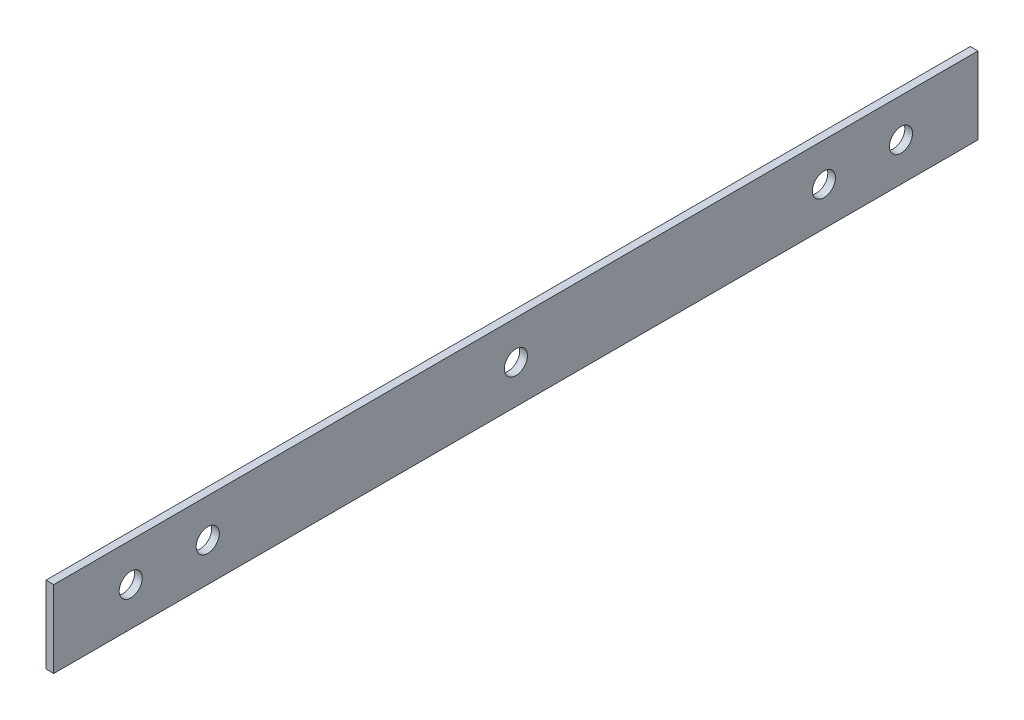
ISO-10303-21;
HEADER;
FILE_DESCRIPTION(('STEP AP214'),'2;1');
FILE_NAME('part.step','',(''),(''),'','','');
FILE_SCHEMA(('AUTOMOTIVE_DESIGN { 1 0 10303 214 1 1 1 1 }'));
ENDSEC;
DATA;
#1=APPLICATION_CONTEXT('core data for automotive mechanical design processes');
#2=APPLICATION_PROTOCOL_DEFINITION('international standard','automotive_design',2000,#1);
#3=PRODUCT_CONTEXT('',#1,'mechanical');
#4=PRODUCT('Part','Part','',(#3));
#5=PRODUCT_RELATED_PRODUCT_CATEGORY('part','',(#4));
#6=PRODUCT_DEFINITION_FORMATION('','',#4);
#7=PRODUCT_DEFINITION_CONTEXT('part definition',#1,'design');
#8=PRODUCT_DEFINITION('design','',#6,#7);
#9=PRODUCT_DEFINITION_SHAPE('','',#8);
#10=(LENGTH_UNIT() NAMED_UNIT(*) SI_UNIT(.MILLI.,.METRE.));
#11=(NAMED_UNIT(*) PLANE_ANGLE_UNIT() SI_UNIT($,.RADIAN.));
#12=(NAMED_UNIT(*) SI_UNIT($,.STERADIAN.) SOLID_ANGLE_UNIT());
#13=UNCERTAINTY_MEASURE_WITH_UNIT(LENGTH_MEASURE(1.E-05),#10,'distance_accuracy_value','');
#14=(GEOMETRIC_REPRESENTATION_CONTEXT(3) GLOBAL_UNCERTAINTY_ASSIGNED_CONTEXT((#13)) GLOBAL_UNIT_ASSIGNED_CONTEXT((#10,
#11,#12)) REPRESENTATION_CONTEXT('',''));
#15=CARTESIAN_POINT('',(0.,0.,0.));
#16=DIRECTION('',(0.,0.,1.));
#17=DIRECTION('',(1.,0.,0.));
#18=AXIS2_PLACEMENT_3D('',#15,#16,#17);
#19=CARTESIAN_POINT('',(1.,0.,0.));
#20=DIRECTION('',(1.,0.,0.));
#21=DIRECTION('',(0.,0.,-1.));
#22=AXIS2_PLACEMENT_3D('',#19,#20,#21);
#23=PLANE('',#22);
#24=CARTESIAN_POINT('',(1.,-1.84898231564898,-7.04768768768769));
#25=DIRECTION('',(1.,0.,0.));
#26=DIRECTION('',(0.,0.,-1.));
#27=AXIS2_PLACEMENT_3D('',#24,#25,#26);
#28=CIRCLE('',#27,1.5);
#29=CARTESIAN_POINT('',(1.,-1.84898231564898,-8.54768768768769));
#30=VERTEX_POINT('',#29);
#31=EDGE_CURVE('E150',#30,#30,#28,.T.);
#32=ORIENTED_EDGE('',*,*,#31,.F.);
#33=EDGE_LOOP('',(#32));
#34=FACE_BOUND('',#33,.T.);
#35=CARTESIAN_POINT('',(1.,-1.84898231564898,2.95231231231231));
#36=DIRECTION('',(1.,0.,0.));
#37=DIRECTION('',(0.,0.,-1.));
#38=AXIS2_PLACEMENT_3D('',#35,#36,#37);
#39=CIRCLE('',#38,1.5);
#40=CARTESIAN_POINT('',(1.,-1.84898231564898,1.45231231231231));
#41=VERTEX_POINT('',#40);
#42=EDGE_CURVE('E134',#41,#41,#39,.T.);
#43=ORIENTED_EDGE('',*,*,#42,.F.);
#44=EDGE_LOOP('',(#43));
#45=FACE_BOUND('',#44,.T.);
#46=DIRECTION('',(0.,-1.,0.));
#47=VECTOR('',#46,1.);
#48=CARTESIAN_POINT('',(1.,3.15101768435102,102.952312312312));
#49=LINE('',#48,#47);
#50=CARTESIAN_POINT('',(1.,3.15101768435102,102.952312312312));
#51=VERTEX_POINT('',#50);
#52=CARTESIAN_POINT('',(1.,-6.84898231564898,102.952312312312));
#53=VERTEX_POINT('',#52);
#54=EDGE_CURVE('E92',#51,#53,#49,.T.);
#55=ORIENTED_EDGE('',*,*,#54,.T.);
#56=DIRECTION('',(0.,0.,-1.));
#57=VECTOR('',#56,1.);
#58=CARTESIAN_POINT('',(1.,-6.84898231564898,102.952312312312));
#59=LINE('',#58,#57);
#60=CARTESIAN_POINT('',(1.,-6.84898231564898,-17.0476876876877));
#61=VERTEX_POINT('',#60);
#62=EDGE_CURVE('E87',#53,#61,#59,.T.);
#63=ORIENTED_EDGE('',*,*,#62,.T.);
#64=DIRECTION('',(0.,1.,0.));
#65=VECTOR('',#64,1.);
#66=CARTESIAN_POINT('',(1.,3.15101768435102,-17.0476876876877));
#67=LINE('',#66,#65);
#68=CARTESIAN_POINT('',(1.,3.15101768435102,-17.0476876876877));
#69=VERTEX_POINT('',#68);
#70=EDGE_CURVE('E90',#61,#69,#67,.T.);
#71=ORIENTED_EDGE('',*,*,#70,.T.);
#72=DIRECTION('',(0.,0.,1.));
#73=VECTOR('',#72,1.);
#74=CARTESIAN_POINT('',(1.,3.15101768435102,102.952312312312));
#75=LINE('',#74,#73);
#76=EDGE_CURVE('E57',#69,#51,#75,.T.);
#77=ORIENTED_EDGE('',*,*,#76,.T.);
#78=EDGE_LOOP('',(#55,#63,#71,#77));
#79=FACE_BOUND('',#78,.T.);
#80=CARTESIAN_POINT('',(1.,-1.84898231564898,82.9523123123123));
#81=DIRECTION('',(1.,0.,0.));
#82=DIRECTION('',(0.,0.,-1.));
#83=AXIS2_PLACEMENT_3D('',#80,#81,#82);
#84=CIRCLE('',#83,1.5);
#85=CARTESIAN_POINT('',(1.,-1.84898231564898,81.4523123123123));
#86=VERTEX_POINT('',#85);
#87=EDGE_CURVE('E112',#86,#86,#84,.T.);
#88=ORIENTED_EDGE('',*,*,#87,.F.);
#89=EDGE_LOOP('',(#88));
#90=FACE_BOUND('',#89,.T.);
#91=CARTESIAN_POINT('',(1.,-1.84898231564905,92.9523123123123));
#92=DIRECTION('',(1.,0.,0.));
#93=DIRECTION('',(0.,0.,-1.));
#94=AXIS2_PLACEMENT_3D('',#91,#92,#93);
#95=CIRCLE('',#94,1.5);
#96=CARTESIAN_POINT('',(1.,-1.84898231564905,91.4523123123123));
#97=VERTEX_POINT('',#96);
#98=EDGE_CURVE('E142',#97,#97,#95,.T.);
#99=ORIENTED_EDGE('',*,*,#98,.F.);
#100=EDGE_LOOP('',(#99));
#101=FACE_BOUND('',#100,.T.);
#102=CARTESIAN_POINT('',(1.,-1.84898231564898,42.9523123123123));
#103=DIRECTION('',(1.,0.,0.));
#104=DIRECTION('',(0.,0.,-1.));
#105=AXIS2_PLACEMENT_3D('',#102,#103,#104);
#106=CIRCLE('',#105,1.5);
#107=CARTESIAN_POINT('',(1.,-1.84898231564898,41.4523123123123));
#108=VERTEX_POINT('',#107);
#109=EDGE_CURVE('E158',#108,#108,#106,.T.);
#110=ORIENTED_EDGE('',*,*,#109,.F.);
#111=EDGE_LOOP('',(#110));
#112=FACE_BOUND('',#111,.T.);
#113=ADVANCED_FACE('F39',(#34,#45,#79,#90,#101,#112),#23,.T.);
#114=CARTESIAN_POINT('',(0.,0.,0.));
#115=DIRECTION('',(1.,0.,0.));
#116=DIRECTION('',(0.,0.,-1.));
#117=AXIS2_PLACEMENT_3D('',#114,#115,#116);
#118=PLANE('',#117);
#119=DIRECTION('',(0.,-1.,0.));
#120=VECTOR('',#119,1.);
#121=CARTESIAN_POINT('',(0.,3.15101768435102,102.952312312312));
#122=LINE('',#121,#120);
#123=CARTESIAN_POINT('',(0.,3.15101768435102,102.952312312312));
#124=VERTEX_POINT('',#123);
#125=CARTESIAN_POINT('',(0.,-6.84898231564898,102.952312312312));
#126=VERTEX_POINT('',#125);
#127=EDGE_CURVE('E108',#124,#126,#122,.T.);
#128=ORIENTED_EDGE('',*,*,#127,.F.);
#129=DIRECTION('',(0.,0.,1.));
#130=VECTOR('',#129,1.);
#131=CARTESIAN_POINT('',(0.,3.15101768435102,102.952312312312));
#132=LINE('',#131,#130);
#133=CARTESIAN_POINT('',(0.,3.15101768435102,-17.0476876876877));
#134=VERTEX_POINT('',#133);
#135=EDGE_CURVE('E80',#134,#124,#132,.T.);
#136=ORIENTED_EDGE('',*,*,#135,.F.);
#137=DIRECTION('',(0.,1.,0.));
#138=VECTOR('',#137,1.);
#139=CARTESIAN_POINT('',(0.,3.15101768435102,-17.0476876876877));
#140=LINE('',#139,#138);
#141=CARTESIAN_POINT('',(0.,-6.84898231564898,-17.0476876876877));
#142=VERTEX_POINT('',#141);
#143=EDGE_CURVE('E74',#142,#134,#140,.T.);
#144=ORIENTED_EDGE('',*,*,#143,.F.);
#145=DIRECTION('',(0.,0.,-1.));
#146=VECTOR('',#145,1.);
#147=CARTESIAN_POINT('',(0.,-6.84898231564898,102.952312312312));
#148=LINE('',#147,#146);
#149=EDGE_CURVE('E97',#126,#142,#148,.T.);
#150=ORIENTED_EDGE('',*,*,#149,.F.);
#151=EDGE_LOOP('',(#128,#136,#144,#150));
#152=FACE_BOUND('',#151,.T.);
#153=CARTESIAN_POINT('',(0.,-1.84898231564898,82.9523123123123));
#154=DIRECTION('',(1.,0.,0.));
#155=DIRECTION('',(0.,0.,-1.));
#156=AXIS2_PLACEMENT_3D('',#153,#154,#155);
#157=CIRCLE('',#156,1.5);
#158=CARTESIAN_POINT('',(0.,-1.84898231564898,81.4523123123123));
#159=VERTEX_POINT('',#158);
#160=EDGE_CURVE('E130',#159,#159,#157,.T.);
#161=ORIENTED_EDGE('',*,*,#160,.T.);
#162=EDGE_LOOP('',(#161));
#163=FACE_BOUND('',#162,.T.);
#164=CARTESIAN_POINT('',(0.,-1.84898231564898,2.95231231231231));
#165=DIRECTION('',(1.,0.,0.));
#166=DIRECTION('',(0.,0.,-1.));
#167=AXIS2_PLACEMENT_3D('',#164,#165,#166);
#168=CIRCLE('',#167,1.5);
#169=CARTESIAN_POINT('',(0.,-1.84898231564898,1.45231231231231));
#170=VERTEX_POINT('',#169);
#171=EDGE_CURVE('E138',#170,#170,#168,.T.);
#172=ORIENTED_EDGE('',*,*,#171,.T.);
#173=EDGE_LOOP('',(#172));
#174=FACE_BOUND('',#173,.T.);
#175=CARTESIAN_POINT('',(0.,-1.84898231564905,92.9523123123123));
#176=DIRECTION('',(1.,0.,0.));
#177=DIRECTION('',(0.,0.,-1.));
#178=AXIS2_PLACEMENT_3D('',#175,#176,#177);
#179=CIRCLE('',#178,1.5);
#180=CARTESIAN_POINT('',(0.,-1.84898231564905,91.4523123123123));
#181=VERTEX_POINT('',#180);
#182=EDGE_CURVE('E146',#181,#181,#179,.T.);
#183=ORIENTED_EDGE('',*,*,#182,.T.);
#184=EDGE_LOOP('',(#183));
#185=FACE_BOUND('',#184,.T.);
#186=CARTESIAN_POINT('',(0.,-1.84898231564898,-7.04768768768769));
#187=DIRECTION('',(1.,0.,0.));
#188=DIRECTION('',(0.,0.,-1.));
#189=AXIS2_PLACEMENT_3D('',#186,#187,#188);
#190=CIRCLE('',#189,1.5);
#191=CARTESIAN_POINT('',(0.,-1.84898231564898,-8.54768768768769));
#192=VERTEX_POINT('',#191);
#193=EDGE_CURVE('E154',#192,#192,#190,.T.);
#194=ORIENTED_EDGE('',*,*,#193,.T.);
#195=EDGE_LOOP('',(#194));
#196=FACE_BOUND('',#195,.T.);
#197=CARTESIAN_POINT('',(0.,-1.84898231564898,42.9523123123123));
#198=DIRECTION('',(1.,0.,0.));
#199=DIRECTION('',(0.,0.,-1.));
#200=AXIS2_PLACEMENT_3D('',#197,#198,#199);
#201=CIRCLE('',#200,1.5);
#202=CARTESIAN_POINT('',(0.,-1.84898231564898,41.4523123123123));
#203=VERTEX_POINT('',#202);
#204=EDGE_CURVE('E162',#203,#203,#201,.T.);
#205=ORIENTED_EDGE('',*,*,#204,.T.);
#206=EDGE_LOOP('',(#205));
#207=FACE_BOUND('',#206,.T.);
#208=ADVANCED_FACE('F125',(#152,#163,#174,#185,#196,#207),#118,.F.);
#209=CARTESIAN_POINT('',(1.,3.15101768435102,102.952312312312));
#210=DIRECTION('',(0.,0.,-1.));
#211=DIRECTION('',(-1.,0.,0.));
#212=AXIS2_PLACEMENT_3D('',#209,#210,#211);
#213=PLANE('',#212);
#214=ORIENTED_EDGE('',*,*,#127,.T.);
#215=DIRECTION('',(-1.,0.,0.));
#216=VECTOR('',#215,1.);
#217=CARTESIAN_POINT('',(1.,-6.84898231564898,102.952312312312));
#218=LINE('',#217,#216);
#219=EDGE_CURVE('E11',#53,#126,#218,.T.);
#220=ORIENTED_EDGE('',*,*,#219,.F.);
#221=ORIENTED_EDGE('',*,*,#54,.F.);
#222=DIRECTION('',(-1.,0.,0.));
#223=VECTOR('',#222,1.);
#224=CARTESIAN_POINT('',(1.,3.15101768435102,102.952312312312));
#225=LINE('',#224,#223);
#226=EDGE_CURVE('E104',#51,#124,#225,.T.);
#227=ORIENTED_EDGE('',*,*,#226,.T.);
#228=EDGE_LOOP('',(#214,#220,#221,#227));
#229=FACE_BOUND('',#228,.T.);
#230=ADVANCED_FACE('F41',(#229),#213,.F.);
#231=CARTESIAN_POINT('',(1.,-6.84898231564898,102.952312312312));
#232=DIRECTION('',(0.,1.,0.));
#233=DIRECTION('',(0.,0.,1.));
#234=AXIS2_PLACEMENT_3D('',#231,#232,#233);
#235=PLANE('',#234);
#236=ORIENTED_EDGE('',*,*,#149,.T.);
#237=DIRECTION('',(-1.,0.,0.));
#238=VECTOR('',#237,1.);
#239=CARTESIAN_POINT('',(1.,-6.84898231564898,-17.0476876876877));
#240=LINE('',#239,#238);
#241=EDGE_CURVE('E49',#61,#142,#240,.T.);
#242=ORIENTED_EDGE('',*,*,#241,.F.);
#243=ORIENTED_EDGE('',*,*,#62,.F.);
#244=ORIENTED_EDGE('',*,*,#219,.T.);
#245=EDGE_LOOP('',(#236,#242,#243,#244));
#246=FACE_BOUND('',#245,.T.);
#247=ADVANCED_FACE('F96',(#246),#235,.F.);
#248=CARTESIAN_POINT('',(1.,3.15101768435102,-17.0476876876877));
#249=DIRECTION('',(0.,0.,1.));
#250=DIRECTION('',(1.,0.,0.));
#251=AXIS2_PLACEMENT_3D('',#248,#249,#250);
#252=PLANE('',#251);
#253=ORIENTED_EDGE('',*,*,#143,.T.);
#254=DIRECTION('',(-1.,0.,0.));
#255=VECTOR('',#254,1.);
#256=CARTESIAN_POINT('',(1.,3.15101768435102,-17.0476876876877));
#257=LINE('',#256,#255);
#258=EDGE_CURVE('E99',#69,#134,#257,.T.);
#259=ORIENTED_EDGE('',*,*,#258,.F.);
#260=ORIENTED_EDGE('',*,*,#70,.F.);
#261=ORIENTED_EDGE('',*,*,#241,.T.);
#262=EDGE_LOOP('',(#253,#259,#260,#261));
#263=FACE_BOUND('',#262,.T.);
#264=ADVANCED_FACE('F100',(#263),#252,.F.);
#265=CARTESIAN_POINT('',(1.,3.15101768435102,102.952312312312));
#266=DIRECTION('',(0.,-1.,0.));
#267=DIRECTION('',(0.,0.,-1.));
#268=AXIS2_PLACEMENT_3D('',#265,#266,#267);
#269=PLANE('',#268);
#270=ORIENTED_EDGE('',*,*,#135,.T.);
#271=ORIENTED_EDGE('',*,*,#226,.F.);
#272=ORIENTED_EDGE('',*,*,#76,.F.);
#273=ORIENTED_EDGE('',*,*,#258,.T.);
#274=EDGE_LOOP('',(#270,#271,#272,#273));
#275=FACE_BOUND('',#274,.T.);
#276=ADVANCED_FACE('F122',(#275),#269,.F.);
#277=CARTESIAN_POINT('',(1.,-1.84898231564898,82.9523123123123));
#278=DIRECTION('',(-1.,0.,0.));
#279=DIRECTION('',(0.,0.,1.));
#280=AXIS2_PLACEMENT_3D('',#277,#278,#279);
#281=CYLINDRICAL_SURFACE('',#280,1.5);
#282=ORIENTED_EDGE('',*,*,#87,.T.);
#283=EDGE_LOOP('',(#282));
#284=FACE_BOUND('',#283,.T.);
#285=ORIENTED_EDGE('',*,*,#160,.F.);
#286=EDGE_LOOP('',(#285));
#287=FACE_BOUND('',#286,.T.);
#288=ADVANCED_FACE('F183',(#284,#287),#281,.F.);
#289=CARTESIAN_POINT('',(1.,-1.84898231564898,2.95231231231231));
#290=DIRECTION('',(-1.,0.,0.));
#291=DIRECTION('',(0.,0.,1.));
#292=AXIS2_PLACEMENT_3D('',#289,#290,#291);
#293=CYLINDRICAL_SURFACE('',#292,1.5);
#294=ORIENTED_EDGE('',*,*,#42,.T.);
#295=EDGE_LOOP('',(#294));
#296=FACE_BOUND('',#295,.T.);
#297=ORIENTED_EDGE('',*,*,#171,.F.);
#298=EDGE_LOOP('',(#297));
#299=FACE_BOUND('',#298,.T.);
#300=ADVANCED_FACE('F229',(#296,#299),#293,.F.);
#301=CARTESIAN_POINT('',(1.,-1.84898231564905,92.9523123123123));
#302=DIRECTION('',(-1.,0.,0.));
#303=DIRECTION('',(0.,0.,1.));
#304=AXIS2_PLACEMENT_3D('',#301,#302,#303);
#305=CYLINDRICAL_SURFACE('',#304,1.5);
#306=ORIENTED_EDGE('',*,*,#98,.T.);
#307=EDGE_LOOP('',(#306));
#308=FACE_BOUND('',#307,.T.);
#309=ORIENTED_EDGE('',*,*,#182,.F.);
#310=EDGE_LOOP('',(#309));
#311=FACE_BOUND('',#310,.T.);
#312=ADVANCED_FACE('F237',(#308,#311),#305,.F.);
#313=CARTESIAN_POINT('',(1.,-1.84898231564898,-7.04768768768769));
#314=DIRECTION('',(-1.,0.,0.));
#315=DIRECTION('',(0.,0.,1.));
#316=AXIS2_PLACEMENT_3D('',#313,#314,#315);
#317=CYLINDRICAL_SURFACE('',#316,1.5);
#318=ORIENTED_EDGE('',*,*,#31,.T.);
#319=EDGE_LOOP('',(#318));
#320=FACE_BOUND('',#319,.T.);
#321=ORIENTED_EDGE('',*,*,#193,.F.);
#322=EDGE_LOOP('',(#321));
#323=FACE_BOUND('',#322,.T.);
#324=ADVANCED_FACE('F245',(#320,#323),#317,.F.);
#325=CARTESIAN_POINT('',(1.,-1.84898231564898,42.9523123123123));
#326=DIRECTION('',(-1.,0.,0.));
#327=DIRECTION('',(0.,0.,1.));
#328=AXIS2_PLACEMENT_3D('',#325,#326,#327);
#329=CYLINDRICAL_SURFACE('',#328,1.5);
#330=ORIENTED_EDGE('',*,*,#109,.T.);
#331=EDGE_LOOP('',(#330));
#332=FACE_BOUND('',#331,.T.);
#333=ORIENTED_EDGE('',*,*,#204,.F.);
#334=EDGE_LOOP('',(#333));
#335=FACE_BOUND('',#334,.T.);
#336=ADVANCED_FACE('F170',(#332,#335),#329,.F.);
#337=CLOSED_SHELL('',(#113,#208,#230,#247,#264,#276,#288,#300,#312,#324,#336));
#338=MANIFOLD_SOLID_BREP('B2',#337);
#339=ADVANCED_BREP_SHAPE_REPRESENTATION('',(#18,#338),#14);
#340=SHAPE_DEFINITION_REPRESENTATION(#9,#339);
ENDSEC;
END-ISO-10303-21;
